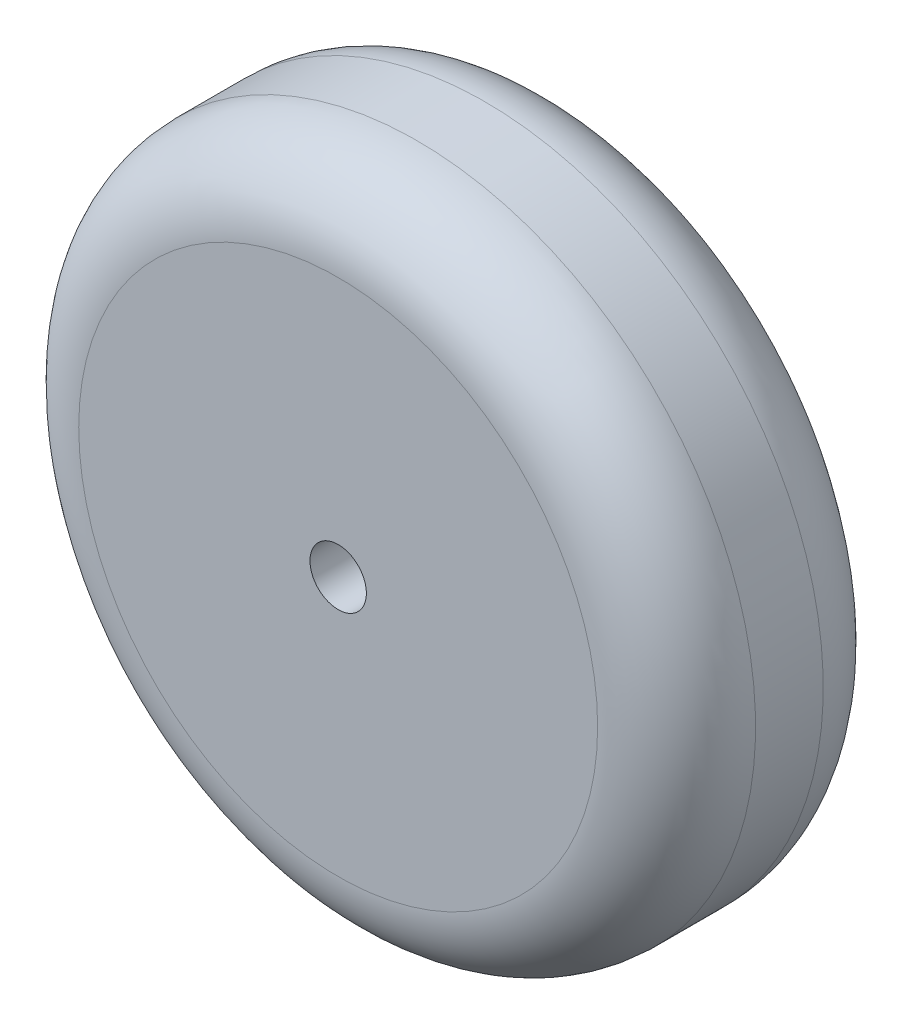
ISO-10303-21;
HEADER;
FILE_DESCRIPTION(('STEP AP214'),'2;1');
FILE_NAME('part.step','',(''),(''),'','','');
FILE_SCHEMA(('AUTOMOTIVE_DESIGN { 1 0 10303 214 1 1 1 1 }'));
ENDSEC;
DATA;
#1=APPLICATION_CONTEXT('core data for automotive mechanical design processes');
#2=APPLICATION_PROTOCOL_DEFINITION('international standard','automotive_design',2000,#1);
#3=PRODUCT_CONTEXT('',#1,'mechanical');
#4=PRODUCT('Part','Part','',(#3));
#5=PRODUCT_RELATED_PRODUCT_CATEGORY('part','',(#4));
#6=PRODUCT_DEFINITION_FORMATION('','',#4);
#7=PRODUCT_DEFINITION_CONTEXT('part definition',#1,'design');
#8=PRODUCT_DEFINITION('design','',#6,#7);
#9=PRODUCT_DEFINITION_SHAPE('','',#8);
#10=(LENGTH_UNIT() NAMED_UNIT(*) SI_UNIT(.MILLI.,.METRE.));
#11=(NAMED_UNIT(*) PLANE_ANGLE_UNIT() SI_UNIT($,.RADIAN.));
#12=(NAMED_UNIT(*) SI_UNIT($,.STERADIAN.) SOLID_ANGLE_UNIT());
#13=UNCERTAINTY_MEASURE_WITH_UNIT(LENGTH_MEASURE(1.E-05),#10,'distance_accuracy_value','');
#14=(GEOMETRIC_REPRESENTATION_CONTEXT(3) GLOBAL_UNCERTAINTY_ASSIGNED_CONTEXT((#13)) GLOBAL_UNIT_ASSIGNED_CONTEXT((#10,
#11,#12)) REPRESENTATION_CONTEXT('',''));
#15=CARTESIAN_POINT('',(0.,0.,0.));
#16=DIRECTION('',(0.,0.,1.));
#17=DIRECTION('',(1.,0.,0.));
#18=AXIS2_PLACEMENT_3D('',#15,#16,#17);
#19=CARTESIAN_POINT('',(0.,0.,-7.62000000000001));
#20=DIRECTION('',(0.,0.,-1.));
#21=DIRECTION('',(-1.,0.,0.));
#22=AXIS2_PLACEMENT_3D('',#19,#20,#21);
#23=TOROIDAL_SURFACE('',#22,58.42,17.78);
#24=CARTESIAN_POINT('',(0.,0.,-7.62000000000001));
#25=DIRECTION('',(0.,0.,-1.));
#26=DIRECTION('',(-1.,0.,0.));
#27=AXIS2_PLACEMENT_3D('',#24,#25,#26);
#28=CIRCLE('',#27,76.2);
#29=CARTESIAN_POINT('',(-76.2,0.,-7.62000000000001));
#30=VERTEX_POINT('',#29);
#31=EDGE_CURVE('E12',#30,#30,#28,.T.);
#32=ORIENTED_EDGE('',*,*,#31,.T.);
#33=EDGE_LOOP('',(#32));
#34=FACE_BOUND('',#33,.T.);
#35=CARTESIAN_POINT('',(0.,0.,-25.4));
#36=DIRECTION('',(0.,0.,-1.));
#37=DIRECTION('',(-1.,0.,0.));
#38=AXIS2_PLACEMENT_3D('',#35,#36,#37);
#39=CIRCLE('',#38,58.42);
#40=CARTESIAN_POINT('',(-58.42,0.,-25.4));
#41=VERTEX_POINT('',#40);
#42=EDGE_CURVE('E64',#41,#41,#39,.T.);
#43=ORIENTED_EDGE('',*,*,#42,.F.);
#44=EDGE_LOOP('',(#43));
#45=FACE_BOUND('',#44,.T.);
#46=ADVANCED_FACE('F48',(#34,#45),#23,.T.);
#47=CARTESIAN_POINT('',(0.,0.,-37.2200726078121));
#48=DIRECTION('',(0.,0.,-1.));
#49=DIRECTION('',(-1.,0.,0.));
#50=AXIS2_PLACEMENT_3D('',#47,#48,#49);
#51=CYLINDRICAL_SURFACE('',#50,76.2);
#52=CARTESIAN_POINT('',(0.,0.,7.62000000000001));
#53=DIRECTION('',(0.,0.,-1.));
#54=DIRECTION('',(-1.,0.,0.));
#55=AXIS2_PLACEMENT_3D('',#52,#53,#54);
#56=CIRCLE('',#55,76.2);
#57=CARTESIAN_POINT('',(-76.2,0.,7.62000000000001));
#58=VERTEX_POINT('',#57);
#59=EDGE_CURVE('E55',#58,#58,#56,.T.);
#60=ORIENTED_EDGE('',*,*,#59,.T.);
#61=EDGE_LOOP('',(#60));
#62=FACE_BOUND('',#61,.T.);
#63=ORIENTED_EDGE('',*,*,#31,.F.);
#64=EDGE_LOOP('',(#63));
#65=FACE_BOUND('',#64,.T.);
#66=ADVANCED_FACE('F87',(#62,#65),#51,.T.);
#67=CARTESIAN_POINT('',(0.,0.,7.62000000000001));
#68=DIRECTION('',(0.,0.,-1.));
#69=DIRECTION('',(-1.,0.,0.));
#70=AXIS2_PLACEMENT_3D('',#67,#68,#69);
#71=TOROIDAL_SURFACE('',#70,58.42,17.78);
#72=CARTESIAN_POINT('',(0.,0.,25.4));
#73=DIRECTION('',(0.,0.,-1.));
#74=DIRECTION('',(-1.,0.,0.));
#75=AXIS2_PLACEMENT_3D('',#72,#73,#74);
#76=CIRCLE('',#75,58.42);
#77=CARTESIAN_POINT('',(-58.42,0.,25.4));
#78=VERTEX_POINT('',#77);
#79=EDGE_CURVE('E59',#78,#78,#76,.T.);
#80=ORIENTED_EDGE('',*,*,#79,.T.);
#81=EDGE_LOOP('',(#80));
#82=FACE_BOUND('',#81,.T.);
#83=ORIENTED_EDGE('',*,*,#59,.F.);
#84=EDGE_LOOP('',(#83));
#85=FACE_BOUND('',#84,.T.);
#86=ADVANCED_FACE('F91',(#82,#85),#71,.T.);
#87=CARTESIAN_POINT('',(0.,0.,25.4));
#88=DIRECTION('',(0.,0.,1.));
#89=DIRECTION('',(1.,0.,0.));
#90=AXIS2_PLACEMENT_3D('',#87,#88,#89);
#91=PLANE('',#90);
#92=CARTESIAN_POINT('',(0.,0.,25.4));
#93=DIRECTION('',(0.,0.,1.));
#94=DIRECTION('',(1.,0.,0.));
#95=AXIS2_PLACEMENT_3D('',#92,#93,#94);
#96=CIRCLE('',#95,6.35);
#97=CARTESIAN_POINT('',(6.35,0.,25.4));
#98=VERTEX_POINT('',#97);
#99=EDGE_CURVE('E67',#98,#98,#96,.F.);
#100=ORIENTED_EDGE('',*,*,#99,.T.);
#101=EDGE_LOOP('',(#100));
#102=FACE_BOUND('',#101,.T.);
#103=ORIENTED_EDGE('',*,*,#79,.F.);
#104=EDGE_LOOP('',(#103));
#105=FACE_BOUND('',#104,.T.);
#106=ADVANCED_FACE('F84',(#102,#105),#91,.T.);
#107=CARTESIAN_POINT('',(0.,0.,-25.4));
#108=DIRECTION('',(0.,0.,-1.));
#109=DIRECTION('',(-1.,0.,0.));
#110=AXIS2_PLACEMENT_3D('',#107,#108,#109);
#111=PLANE('',#110);
#112=CARTESIAN_POINT('',(0.,0.,-25.4));
#113=DIRECTION('',(0.,0.,-1.));
#114=DIRECTION('',(-1.,0.,0.));
#115=AXIS2_PLACEMENT_3D('',#112,#113,#114);
#116=CIRCLE('',#115,6.35);
#117=CARTESIAN_POINT('',(-6.35,0.,-25.4));
#118=VERTEX_POINT('',#117);
#119=EDGE_CURVE('E51',#118,#118,#116,.F.);
#120=ORIENTED_EDGE('',*,*,#119,.T.);
#121=EDGE_LOOP('',(#120));
#122=FACE_BOUND('',#121,.T.);
#123=ORIENTED_EDGE('',*,*,#42,.T.);
#124=EDGE_LOOP('',(#123));
#125=FACE_BOUND('',#124,.T.);
#126=ADVANCED_FACE('F74',(#122,#125),#111,.T.);
#127=CARTESIAN_POINT('',(0.,0.,108.458));
#128=DIRECTION('',(0.,0.,-1.));
#129=DIRECTION('',(-1.,0.,0.));
#130=AXIS2_PLACEMENT_3D('',#127,#128,#129);
#131=CYLINDRICAL_SURFACE('',#130,6.35);
#132=ORIENTED_EDGE('',*,*,#99,.F.);
#133=EDGE_LOOP('',(#132));
#134=FACE_BOUND('',#133,.T.);
#135=ORIENTED_EDGE('',*,*,#119,.F.);
#136=EDGE_LOOP('',(#135));
#137=FACE_BOUND('',#136,.T.);
#138=ADVANCED_FACE('F77',(#134,#137),#131,.F.);
#139=CLOSED_SHELL('',(#46,#66,#86,#106,#126,#138));
#140=MANIFOLD_SOLID_BREP('B2',#139);
#141=ADVANCED_BREP_SHAPE_REPRESENTATION('',(#18,#140),#14);
#142=SHAPE_DEFINITION_REPRESENTATION(#9,#141);
ENDSEC;
END-ISO-10303-21;
